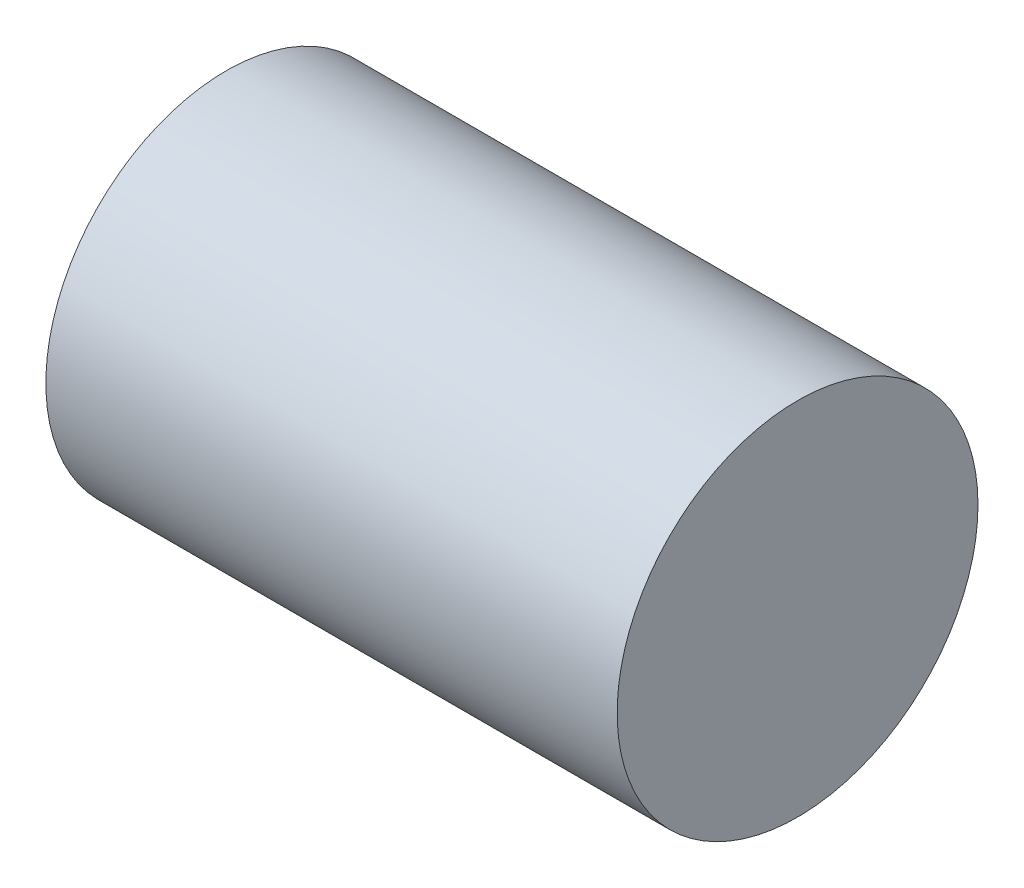
ISO-10303-21;
HEADER;
FILE_DESCRIPTION(('STEP AP214'),'2;1');
FILE_NAME('part.step','',(''),(''),'','','');
FILE_SCHEMA(('AUTOMOTIVE_DESIGN { 1 0 10303 214 1 1 1 1 }'));
ENDSEC;
DATA;
#1=APPLICATION_CONTEXT('core data for automotive mechanical design processes');
#2=APPLICATION_PROTOCOL_DEFINITION('international standard','automotive_design',2000,#1);
#3=PRODUCT_CONTEXT('',#1,'mechanical');
#4=PRODUCT('Part','Part','',(#3));
#5=PRODUCT_RELATED_PRODUCT_CATEGORY('part','',(#4));
#6=PRODUCT_DEFINITION_FORMATION('','',#4);
#7=PRODUCT_DEFINITION_CONTEXT('part definition',#1,'design');
#8=PRODUCT_DEFINITION('design','',#6,#7);
#9=PRODUCT_DEFINITION_SHAPE('','',#8);
#10=(LENGTH_UNIT() NAMED_UNIT(*) SI_UNIT(.MILLI.,.METRE.));
#11=(NAMED_UNIT(*) PLANE_ANGLE_UNIT() SI_UNIT($,.RADIAN.));
#12=(NAMED_UNIT(*) SI_UNIT($,.STERADIAN.) SOLID_ANGLE_UNIT());
#13=UNCERTAINTY_MEASURE_WITH_UNIT(LENGTH_MEASURE(1.E-05),#10,'distance_accuracy_value','');
#14=(GEOMETRIC_REPRESENTATION_CONTEXT(3) GLOBAL_UNCERTAINTY_ASSIGNED_CONTEXT((#13)) GLOBAL_UNIT_ASSIGNED_CONTEXT((#10,
#11,#12)) REPRESENTATION_CONTEXT('',''));
#15=CARTESIAN_POINT('',(0.,0.,0.));
#16=DIRECTION('',(0.,0.,1.));
#17=DIRECTION('',(1.,0.,0.));
#18=AXIS2_PLACEMENT_3D('',#15,#16,#17);
#19=CARTESIAN_POINT('',(9.5,0.,0.));
#20=DIRECTION('',(-1.,0.,0.));
#21=DIRECTION('',(0.,0.,1.));
#22=AXIS2_PLACEMENT_3D('',#19,#20,#21);
#23=CYLINDRICAL_SURFACE('',#22,3.);
#24=CARTESIAN_POINT('',(9.5,0.,0.));
#25=DIRECTION('',(1.,0.,0.));
#26=DIRECTION('',(0.,0.,-1.));
#27=AXIS2_PLACEMENT_3D('',#24,#25,#26);
#28=CIRCLE('',#27,3.);
#29=CARTESIAN_POINT('',(9.5,0.,-3.));
#30=VERTEX_POINT('',#29);
#31=EDGE_CURVE('E10',#30,#30,#28,.T.);
#32=ORIENTED_EDGE('',*,*,#31,.F.);
#33=EDGE_LOOP('',(#32));
#34=FACE_BOUND('',#33,.T.);
#35=CARTESIAN_POINT('',(0.,0.,0.));
#36=DIRECTION('',(1.,0.,0.));
#37=DIRECTION('',(0.,0.,-1.));
#38=AXIS2_PLACEMENT_3D('',#35,#36,#37);
#39=CIRCLE('',#38,3.);
#40=CARTESIAN_POINT('',(0.,0.,-3.));
#41=VERTEX_POINT('',#40);
#42=EDGE_CURVE('E30',#41,#41,#39,.T.);
#43=ORIENTED_EDGE('',*,*,#42,.T.);
#44=EDGE_LOOP('',(#43));
#45=FACE_BOUND('',#44,.T.);
#46=ADVANCED_FACE('F27',(#34,#45),#23,.T.);
#47=CARTESIAN_POINT('',(9.5,0.,0.));
#48=DIRECTION('',(1.,0.,0.));
#49=DIRECTION('',(0.,0.,-1.));
#50=AXIS2_PLACEMENT_3D('',#47,#48,#49);
#51=PLANE('',#50);
#52=ORIENTED_EDGE('',*,*,#31,.T.);
#53=EDGE_LOOP('',(#52));
#54=FACE_BOUND('',#53,.T.);
#55=ADVANCED_FACE('F42',(#54),#51,.T.);
#56=CARTESIAN_POINT('',(0.,0.,0.));
#57=DIRECTION('',(1.,0.,0.));
#58=DIRECTION('',(0.,0.,-1.));
#59=AXIS2_PLACEMENT_3D('',#56,#57,#58);
#60=PLANE('',#59);
#61=ORIENTED_EDGE('',*,*,#42,.F.);
#62=EDGE_LOOP('',(#61));
#63=FACE_BOUND('',#62,.T.);
#64=ADVANCED_FACE('F40',(#63),#60,.F.);
#65=CLOSED_SHELL('',(#46,#55,#64));
#66=MANIFOLD_SOLID_BREP('B2',#65);
#67=ADVANCED_BREP_SHAPE_REPRESENTATION('',(#18,#66),#14);
#68=SHAPE_DEFINITION_REPRESENTATION(#9,#67);
ENDSEC;
END-ISO-10303-21;
